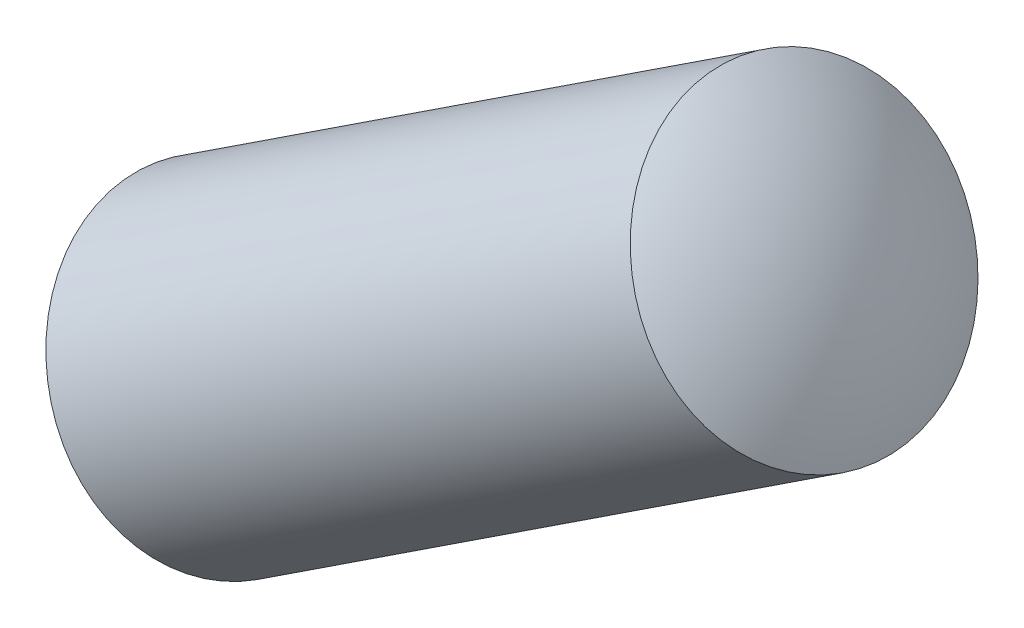
ISO-10303-21;
HEADER;
FILE_DESCRIPTION(('STEP AP214'),'2;1');
FILE_NAME('part.step','',(''),(''),'','','');
FILE_SCHEMA(('AUTOMOTIVE_DESIGN { 1 0 10303 214 1 1 1 1 }'));
ENDSEC;
DATA;
#1=APPLICATION_CONTEXT('core data for automotive mechanical design processes');
#2=APPLICATION_PROTOCOL_DEFINITION('international standard','automotive_design',2000,#1);
#3=PRODUCT_CONTEXT('',#1,'mechanical');
#4=PRODUCT('Part','Part','',(#3));
#5=PRODUCT_RELATED_PRODUCT_CATEGORY('part','',(#4));
#6=PRODUCT_DEFINITION_FORMATION('','',#4);
#7=PRODUCT_DEFINITION_CONTEXT('part definition',#1,'design');
#8=PRODUCT_DEFINITION('design','',#6,#7);
#9=PRODUCT_DEFINITION_SHAPE('','',#8);
#10=(LENGTH_UNIT() NAMED_UNIT(*) SI_UNIT(.MILLI.,.METRE.));
#11=(NAMED_UNIT(*) PLANE_ANGLE_UNIT() SI_UNIT($,.RADIAN.));
#12=(NAMED_UNIT(*) SI_UNIT($,.STERADIAN.) SOLID_ANGLE_UNIT());
#13=UNCERTAINTY_MEASURE_WITH_UNIT(LENGTH_MEASURE(1.E-05),#10,'distance_accuracy_value','');
#14=(GEOMETRIC_REPRESENTATION_CONTEXT(3) GLOBAL_UNCERTAINTY_ASSIGNED_CONTEXT((#13)) GLOBAL_UNIT_ASSIGNED_CONTEXT((#10,
#11,#12)) REPRESENTATION_CONTEXT('',''));
#15=CARTESIAN_POINT('',(0.,0.,0.));
#16=DIRECTION('',(0.,0.,1.));
#17=DIRECTION('',(1.,0.,0.));
#18=AXIS2_PLACEMENT_3D('',#15,#16,#17);
#19=CARTESIAN_POINT('',(-18.6405677072061,-12.2636429015639,0.6));
#20=DIRECTION('',(-0.549619989531633,0.835414787460246,0.));
#21=DIRECTION('',(-0.835414787460246,-0.549619989531633,0.));
#22=AXIS2_PLACEMENT_3D('',#19,#20,#21);
#23=SPHERICAL_SURFACE('',#22,2.);
#24=CARTESIAN_POINT('',(-18.6405677072061,-12.2636429015639,0.6));
#25=DIRECTION('',(0.835414787460246,0.549619989531633,0.));
#26=DIRECTION('',(0.,0.,-1.));
#27=AXIS2_PLACEMENT_3D('',#24,#25,#26);
#28=SPHERICAL_SURFACE('',#27,2.);
#29=CARTESIAN_POINT('',(-20.0875485644816,-13.2156126482881,0.599999999999989));
#30=DIRECTION('',(0.835414787460246,0.549619989531633,0.));
#31=DIRECTION('',(0.,0.,-1.));
#32=AXIS2_PLACEMENT_3D('',#29,#30,#31);
#33=CIRCLE('',#32,1.);
#34=CARTESIAN_POINT('',(-20.0875485644816,-13.2156126482881,-0.400000000000011));
#35=VERTEX_POINT('',#34);
#36=EDGE_CURVE('E11',#35,#35,#33,.T.);
#37=ORIENTED_EDGE('',*,*,#36,.F.);
#38=EDGE_LOOP('',(#37));
#39=FACE_BOUND('',#38,.T.);
#40=ADVANCED_FACE('F17',(#39),#28,.T.);
#41=CARTESIAN_POINT('',(-17.6999755473146,-11.6448266430622,0.599999999999989));
#42=DIRECTION('',(-0.549619989531633,0.835414787460246,0.));
#43=DIRECTION('',(0.835414787460246,0.549619989531633,0.));
#44=AXIS2_PLACEMENT_3D('',#41,#42,#43);
#45=SPHERICAL_SURFACE('',#44,2.);
#46=CARTESIAN_POINT('',(-17.6999755473146,-11.6448266430622,0.599999999999989));
#47=DIRECTION('',(0.835414787460246,0.549619989531633,0.));
#48=DIRECTION('',(0.,0.,-1.));
#49=AXIS2_PLACEMENT_3D('',#46,#47,#48);
#50=SPHERICAL_SURFACE('',#49,2.);
#51=CARTESIAN_POINT('',(-16.2529946900391,-10.6928568963379,0.599999999999989));
#52=DIRECTION('',(0.835414787460246,0.549619989531633,0.));
#53=DIRECTION('',(0.,0.,-1.));
#54=AXIS2_PLACEMENT_3D('',#51,#52,#53);
#55=CIRCLE('',#54,1.);
#56=CARTESIAN_POINT('',(-16.2529946900391,-10.6928568963379,-0.400000000000011));
#57=VERTEX_POINT('',#56);
#58=EDGE_CURVE('E26',#57,#57,#55,.T.);
#59=ORIENTED_EDGE('',*,*,#58,.T.);
#60=EDGE_LOOP('',(#59));
#61=FACE_BOUND('',#60,.T.);
#62=ADVANCED_FACE('F19',(#61),#50,.T.);
#63=CARTESIAN_POINT('',(-17.2116331586497,-11.3235458343255,0.599999999999989));
#64=DIRECTION('',(0.835414787460246,0.549619989531633,0.));
#65=DIRECTION('',(0.,0.,-1.));
#66=AXIS2_PLACEMENT_3D('',#63,#64,#65);
#67=CYLINDRICAL_SURFACE('',#66,1.);
#68=ORIENTED_EDGE('',*,*,#36,.T.);
#69=EDGE_LOOP('',(#68));
#70=FACE_BOUND('',#69,.T.);
#71=ORIENTED_EDGE('',*,*,#58,.F.);
#72=EDGE_LOOP('',(#71));
#73=FACE_BOUND('',#72,.T.);
#74=ADVANCED_FACE('F57',(#70,#73),#67,.T.);
#75=CLOSED_SHELL('',(#40,#62,#74));
#76=MANIFOLD_SOLID_BREP('B1',#75);
#77=ADVANCED_BREP_SHAPE_REPRESENTATION('',(#18,#76),#14);
#78=SHAPE_DEFINITION_REPRESENTATION(#9,#77);
ENDSEC;
END-ISO-10303-21;
